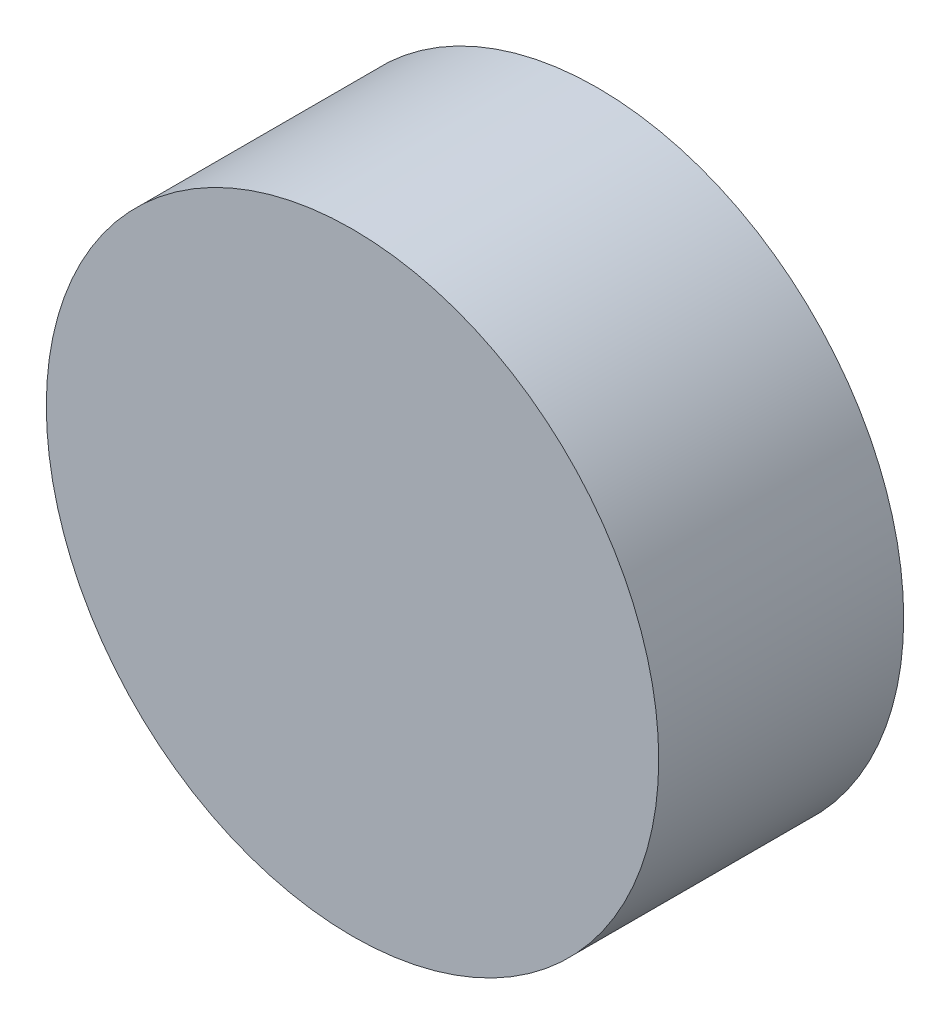
ISO-10303-21;
HEADER;
FILE_DESCRIPTION(('STEP AP214'),'2;1');
FILE_NAME('part.step','',(''),(''),'','','');
FILE_SCHEMA(('AUTOMOTIVE_DESIGN { 1 0 10303 214 1 1 1 1 }'));
ENDSEC;
DATA;
#1=APPLICATION_CONTEXT('core data for automotive mechanical design processes');
#2=APPLICATION_PROTOCOL_DEFINITION('international standard','automotive_design',2000,#1);
#3=PRODUCT_CONTEXT('',#1,'mechanical');
#4=PRODUCT('Part','Part','',(#3));
#5=PRODUCT_RELATED_PRODUCT_CATEGORY('part','',(#4));
#6=PRODUCT_DEFINITION_FORMATION('','',#4);
#7=PRODUCT_DEFINITION_CONTEXT('part definition',#1,'design');
#8=PRODUCT_DEFINITION('design','',#6,#7);
#9=PRODUCT_DEFINITION_SHAPE('','',#8);
#10=(LENGTH_UNIT() NAMED_UNIT(*) SI_UNIT(.MILLI.,.METRE.));
#11=(NAMED_UNIT(*) PLANE_ANGLE_UNIT() SI_UNIT($,.RADIAN.));
#12=(NAMED_UNIT(*) SI_UNIT($,.STERADIAN.) SOLID_ANGLE_UNIT());
#13=UNCERTAINTY_MEASURE_WITH_UNIT(LENGTH_MEASURE(1.E-05),#10,'distance_accuracy_value','');
#14=(GEOMETRIC_REPRESENTATION_CONTEXT(3) GLOBAL_UNCERTAINTY_ASSIGNED_CONTEXT((#13)) GLOBAL_UNIT_ASSIGNED_CONTEXT((#10,
#11,#12)) REPRESENTATION_CONTEXT('',''));
#15=CARTESIAN_POINT('',(0.,0.,0.));
#16=DIRECTION('',(0.,0.,1.));
#17=DIRECTION('',(1.,0.,0.));
#18=AXIS2_PLACEMENT_3D('',#15,#16,#17);
#19=CARTESIAN_POINT('',(0.,0.,40.));
#20=DIRECTION('',(0.,0.,-1.));
#21=DIRECTION('',(-1.,0.,0.));
#22=AXIS2_PLACEMENT_3D('',#19,#20,#21);
#23=CYLINDRICAL_SURFACE('',#22,50.);
#24=CARTESIAN_POINT('',(0.,0.,40.));
#25=DIRECTION('',(0.,0.,1.));
#26=DIRECTION('',(1.,0.,0.));
#27=AXIS2_PLACEMENT_3D('',#24,#25,#26);
#28=CIRCLE('',#27,50.);
#29=CARTESIAN_POINT('',(50.,0.,40.));
#30=VERTEX_POINT('',#29);
#31=EDGE_CURVE('E10',#30,#30,#28,.T.);
#32=ORIENTED_EDGE('',*,*,#31,.F.);
#33=EDGE_LOOP('',(#32));
#34=FACE_BOUND('',#33,.T.);
#35=CARTESIAN_POINT('',(0.,0.,0.));
#36=DIRECTION('',(0.,0.,1.));
#37=DIRECTION('',(1.,0.,0.));
#38=AXIS2_PLACEMENT_3D('',#35,#36,#37);
#39=CIRCLE('',#38,50.);
#40=CARTESIAN_POINT('',(50.,0.,0.));
#41=VERTEX_POINT('',#40);
#42=EDGE_CURVE('E33',#41,#41,#39,.T.);
#43=ORIENTED_EDGE('',*,*,#42,.T.);
#44=EDGE_LOOP('',(#43));
#45=FACE_BOUND('',#44,.T.);
#46=ADVANCED_FACE('F30',(#34,#45),#23,.T.);
#47=CARTESIAN_POINT('',(0.,0.,40.));
#48=DIRECTION('',(0.,0.,1.));
#49=DIRECTION('',(1.,0.,0.));
#50=AXIS2_PLACEMENT_3D('',#47,#48,#49);
#51=PLANE('',#50);
#52=ORIENTED_EDGE('',*,*,#31,.T.);
#53=EDGE_LOOP('',(#52));
#54=FACE_BOUND('',#53,.T.);
#55=ADVANCED_FACE('F45',(#54),#51,.T.);
#56=CARTESIAN_POINT('',(0.,0.,0.));
#57=DIRECTION('',(0.,0.,1.));
#58=DIRECTION('',(1.,0.,0.));
#59=AXIS2_PLACEMENT_3D('',#56,#57,#58);
#60=PLANE('',#59);
#61=ORIENTED_EDGE('',*,*,#42,.F.);
#62=EDGE_LOOP('',(#61));
#63=FACE_BOUND('',#62,.T.);
#64=ADVANCED_FACE('F43',(#63),#60,.F.);
#65=CLOSED_SHELL('',(#46,#55,#64));
#66=MANIFOLD_SOLID_BREP('B2',#65);
#67=ADVANCED_BREP_SHAPE_REPRESENTATION('',(#18,#66),#14);
#68=SHAPE_DEFINITION_REPRESENTATION(#9,#67);
ENDSEC;
END-ISO-10303-21;
